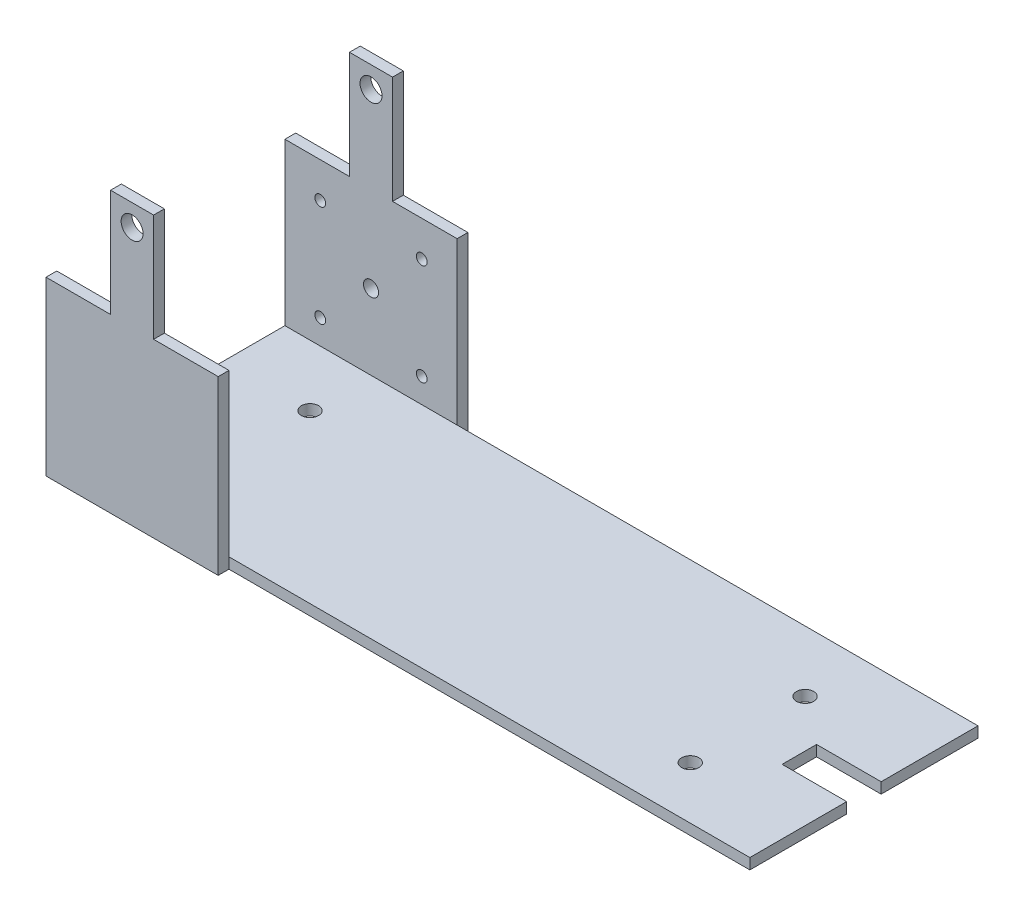
ISO-10303-21;
HEADER;
FILE_DESCRIPTION(('STEP AP214'),'2;1');
FILE_NAME('part.step','',(''),(''),'','','');
FILE_SCHEMA(('AUTOMOTIVE_DESIGN { 1 0 10303 214 1 1 1 1 }'));
ENDSEC;
DATA;
#1=APPLICATION_CONTEXT('core data for automotive mechanical design processes');
#2=APPLICATION_PROTOCOL_DEFINITION('international standard','automotive_design',2000,#1);
#3=PRODUCT_CONTEXT('',#1,'mechanical');
#4=PRODUCT('Part','Part','',(#3));
#5=PRODUCT_RELATED_PRODUCT_CATEGORY('part','',(#4));
#6=PRODUCT_DEFINITION_FORMATION('','',#4);
#7=PRODUCT_DEFINITION_CONTEXT('part definition',#1,'design');
#8=PRODUCT_DEFINITION('design','',#6,#7);
#9=PRODUCT_DEFINITION_SHAPE('','',#8);
#10=(LENGTH_UNIT() NAMED_UNIT(*) SI_UNIT(.MILLI.,.METRE.));
#11=(NAMED_UNIT(*) PLANE_ANGLE_UNIT() SI_UNIT($,.RADIAN.));
#12=(NAMED_UNIT(*) SI_UNIT($,.STERADIAN.) SOLID_ANGLE_UNIT());
#13=UNCERTAINTY_MEASURE_WITH_UNIT(LENGTH_MEASURE(1.E-05),#10,'distance_accuracy_value','');
#14=(GEOMETRIC_REPRESENTATION_CONTEXT(3) GLOBAL_UNCERTAINTY_ASSIGNED_CONTEXT((#13)) GLOBAL_UNIT_ASSIGNED_CONTEXT((#10,
#11,#12)) REPRESENTATION_CONTEXT('',''));
#15=CARTESIAN_POINT('',(0.,0.,0.));
#16=DIRECTION('',(0.,0.,1.));
#17=DIRECTION('',(1.,0.,0.));
#18=AXIS2_PLACEMENT_3D('',#15,#16,#17);
#19=CARTESIAN_POINT('',(282.,-115.,111.));
#20=DIRECTION('',(-1.,0.,0.));
#21=DIRECTION('',(0.,0.,1.));
#22=AXIS2_PLACEMENT_3D('',#19,#20,#21);
#23=PLANE('',#22);
#24=DIRECTION('',(0.,0.,-1.));
#25=VECTOR('',#24,1.);
#26=CARTESIAN_POINT('',(282.,-120.,111.));
#27=LINE('',#26,#25);
#28=CARTESIAN_POINT('',(282.,-120.,111.));
#29=VERTEX_POINT('',#28);
#30=CARTESIAN_POINT('',(282.,-120.,66.));
#31=VERTEX_POINT('',#30);
#32=EDGE_CURVE('E389',#29,#31,#27,.T.);
#33=ORIENTED_EDGE('',*,*,#32,.T.);
#34=DIRECTION('',(0.,1.,0.));
#35=VECTOR('',#34,1.);
#36=CARTESIAN_POINT('',(282.,-125.,66.));
#37=LINE('',#36,#35);
#38=CARTESIAN_POINT('',(282.,-115.,66.));
#39=VERTEX_POINT('',#38);
#40=EDGE_CURVE('E230',#31,#39,#37,.T.);
#41=ORIENTED_EDGE('',*,*,#40,.T.);
#42=DIRECTION('',(0.,0.,-1.));
#43=VECTOR('',#42,1.);
#44=CARTESIAN_POINT('',(282.,-115.,111.));
#45=LINE('',#44,#43);
#46=CARTESIAN_POINT('',(282.,-115.,111.));
#47=VERTEX_POINT('',#46);
#48=EDGE_CURVE('E385',#47,#39,#45,.T.);
#49=ORIENTED_EDGE('',*,*,#48,.F.);
#50=DIRECTION('',(0.,1.,0.));
#51=VECTOR('',#50,1.);
#52=CARTESIAN_POINT('',(282.,-115.,111.));
#53=LINE('',#52,#51);
#54=EDGE_CURVE('E364',#29,#47,#53,.T.);
#55=ORIENTED_EDGE('',*,*,#54,.F.);
#56=EDGE_LOOP('',(#33,#41,#49,#55));
#57=FACE_BOUND('',#56,.T.);
#58=ADVANCED_FACE('F41',(#57),#23,.F.);
#59=CARTESIAN_POINT('',(0.,0.,111.));
#60=DIRECTION('',(0.,0.,-1.));
#61=DIRECTION('',(-1.,0.,0.));
#62=AXIS2_PLACEMENT_3D('',#59,#60,#61);
#63=PLANE('',#62);
#64=DIRECTION('',(0.,1.,0.));
#65=VECTOR('',#64,1.);
#66=CARTESIAN_POINT('',(40.,-115.,111.));
#67=LINE('',#66,#65);
#68=CARTESIAN_POINT('',(40.,-120.,111.));
#69=VERTEX_POINT('',#68);
#70=CARTESIAN_POINT('',(40.,-115.,111.));
#71=VERTEX_POINT('',#70);
#72=EDGE_CURVE('E68',#69,#71,#67,.T.);
#73=ORIENTED_EDGE('',*,*,#72,.F.);
#74=DIRECTION('',(1.,0.,0.));
#75=VECTOR('',#74,1.);
#76=CARTESIAN_POINT('',(282.,-120.,111.));
#77=LINE('',#76,#75);
#78=EDGE_CURVE('E361',#69,#29,#77,.T.);
#79=ORIENTED_EDGE('',*,*,#78,.T.);
#80=ORIENTED_EDGE('',*,*,#54,.T.);
#81=DIRECTION('',(-1.,0.,0.));
#82=VECTOR('',#81,1.);
#83=CARTESIAN_POINT('',(-40.,-115.,111.));
#84=LINE('',#83,#82);
#85=EDGE_CURVE('E368',#47,#71,#84,.T.);
#86=ORIENTED_EDGE('',*,*,#85,.T.);
#87=EDGE_LOOP('',(#73,#79,#80,#86));
#88=FACE_BOUND('',#87,.T.);
#89=ADVANCED_FACE('F559',(#88),#63,.F.);
#90=CARTESIAN_POINT('',(0.,0.,5.));
#91=DIRECTION('',(0.,0.,-1.));
#92=DIRECTION('',(-1.,0.,0.));
#93=AXIS2_PLACEMENT_3D('',#90,#91,#92);
#94=PLANE('',#93);
#95=CARTESIAN_POINT('',(0.,-80.,5.));
#96=DIRECTION('',(0.,0.,1.));
#97=DIRECTION('',(1.,0.,0.));
#98=AXIS2_PLACEMENT_3D('',#95,#96,#97);
#99=CIRCLE('',#98,3.5);
#100=CARTESIAN_POINT('',(3.5,-80.,5.));
#101=VERTEX_POINT('',#100);
#102=EDGE_CURVE('E410',#101,#101,#99,.T.);
#103=ORIENTED_EDGE('',*,*,#102,.F.);
#104=EDGE_LOOP('',(#103));
#105=FACE_BOUND('',#104,.T.);
#106=CARTESIAN_POINT('',(0.,0.,5.));
#107=DIRECTION('',(0.,0.,1.));
#108=DIRECTION('',(1.,0.,0.));
#109=AXIS2_PLACEMENT_3D('',#106,#107,#108);
#110=CIRCLE('',#109,5.1);
#111=CARTESIAN_POINT('',(5.1,0.,5.));
#112=VERTEX_POINT('',#111);
#113=EDGE_CURVE('E419',#112,#112,#110,.T.);
#114=ORIENTED_EDGE('',*,*,#113,.F.);
#115=EDGE_LOOP('',(#114));
#116=FACE_BOUND('',#115,.T.);
#117=CARTESIAN_POINT('',(-23.5700000000004,-56.4299999999999,5.));
#118=DIRECTION('',(0.,0.,1.));
#119=DIRECTION('',(1.,0.,0.));
#120=AXIS2_PLACEMENT_3D('',#117,#118,#119);
#121=CIRCLE('',#120,2.5);
#122=CARTESIAN_POINT('',(-21.0700000000004,-56.4299999999999,5.));
#123=VERTEX_POINT('',#122);
#124=EDGE_CURVE('E402',#123,#123,#121,.T.);
#125=ORIENTED_EDGE('',*,*,#124,.F.);
#126=EDGE_LOOP('',(#125));
#127=FACE_BOUND('',#126,.T.);
#128=CARTESIAN_POINT('',(23.5699999999995,-103.57,5.));
#129=DIRECTION('',(0.,0.,1.));
#130=DIRECTION('',(1.,0.,0.));
#131=AXIS2_PLACEMENT_3D('',#128,#129,#130);
#132=CIRCLE('',#131,2.5);
#133=CARTESIAN_POINT('',(26.0699999999996,-103.57,5.));
#134=VERTEX_POINT('',#133);
#135=EDGE_CURVE('E393',#134,#134,#132,.T.);
#136=ORIENTED_EDGE('',*,*,#135,.F.);
#137=EDGE_LOOP('',(#136));
#138=FACE_BOUND('',#137,.T.);
#139=CARTESIAN_POINT('',(-23.5700000000004,-103.57,5.));
#140=DIRECTION('',(0.,0.,1.));
#141=DIRECTION('',(1.,0.,0.));
#142=AXIS2_PLACEMENT_3D('',#139,#140,#141);
#143=CIRCLE('',#142,2.5);
#144=CARTESIAN_POINT('',(-21.0700000000004,-103.57,5.));
#145=VERTEX_POINT('',#144);
#146=EDGE_CURVE('E397',#145,#145,#143,.T.);
#147=ORIENTED_EDGE('',*,*,#146,.F.);
#148=EDGE_LOOP('',(#147));
#149=FACE_BOUND('',#148,.T.);
#150=CARTESIAN_POINT('',(23.5699999999995,-56.4299999999999,5.));
#151=DIRECTION('',(0.,0.,1.));
#152=DIRECTION('',(1.,0.,0.));
#153=AXIS2_PLACEMENT_3D('',#150,#151,#152);
#154=CIRCLE('',#153,2.5);
#155=CARTESIAN_POINT('',(26.0699999999995,-56.4299999999999,5.));
#156=VERTEX_POINT('',#155);
#157=EDGE_CURVE('E398',#156,#156,#154,.T.);
#158=ORIENTED_EDGE('',*,*,#157,.F.);
#159=EDGE_LOOP('',(#158));
#160=FACE_BOUND('',#159,.T.);
#161=DIRECTION('',(-1.,0.,0.));
#162=VECTOR('',#161,1.);
#163=CARTESIAN_POINT('',(-40.,-115.,5.));
#164=LINE('',#163,#162);
#165=CARTESIAN_POINT('',(40.,-115.,5.));
#166=VERTEX_POINT('',#165);
#167=CARTESIAN_POINT('',(-40.,-115.,5.));
#168=VERTEX_POINT('',#167);
#169=EDGE_CURVE('E11',#166,#168,#164,.T.);
#170=ORIENTED_EDGE('',*,*,#169,.F.);
#171=DIRECTION('',(0.,1.,0.));
#172=VECTOR('',#171,1.);
#173=CARTESIAN_POINT('',(40.,-40.,5.));
#174=LINE('',#173,#172);
#175=CARTESIAN_POINT('',(40.,-40.,5.));
#176=VERTEX_POINT('',#175);
#177=EDGE_CURVE('E444',#166,#176,#174,.T.);
#178=ORIENTED_EDGE('',*,*,#177,.T.);
#179=DIRECTION('',(-1.,0.,0.));
#180=VECTOR('',#179,1.);
#181=CARTESIAN_POINT('',(10.,-40.,5.));
#182=LINE('',#181,#180);
#183=CARTESIAN_POINT('',(10.,-40.,5.));
#184=VERTEX_POINT('',#183);
#185=EDGE_CURVE('E449',#176,#184,#182,.T.);
#186=ORIENTED_EDGE('',*,*,#185,.T.);
#187=DIRECTION('',(0.,1.,0.));
#188=VECTOR('',#187,1.);
#189=CARTESIAN_POINT('',(10.,-40.,5.));
#190=LINE('',#189,#188);
#191=CARTESIAN_POINT('',(10.,10.,5.));
#192=VERTEX_POINT('',#191);
#193=EDGE_CURVE('E427',#184,#192,#190,.T.);
#194=ORIENTED_EDGE('',*,*,#193,.T.);
#195=DIRECTION('',(-1.,0.,0.));
#196=VECTOR('',#195,1.);
#197=CARTESIAN_POINT('',(-10.,10.,5.));
#198=LINE('',#197,#196);
#199=CARTESIAN_POINT('',(-10.,10.,5.));
#200=VERTEX_POINT('',#199);
#201=EDGE_CURVE('E431',#192,#200,#198,.T.);
#202=ORIENTED_EDGE('',*,*,#201,.T.);
#203=DIRECTION('',(0.,-1.,0.));
#204=VECTOR('',#203,1.);
#205=CARTESIAN_POINT('',(-10.,-40.,5.));
#206=LINE('',#205,#204);
#207=CARTESIAN_POINT('',(-10.,-40.,5.));
#208=VERTEX_POINT('',#207);
#209=EDGE_CURVE('E435',#200,#208,#206,.T.);
#210=ORIENTED_EDGE('',*,*,#209,.T.);
#211=DIRECTION('',(-1.,0.,0.));
#212=VECTOR('',#211,1.);
#213=CARTESIAN_POINT('',(-40.,-40.,5.));
#214=LINE('',#213,#212);
#215=CARTESIAN_POINT('',(-40.,-40.,5.));
#216=VERTEX_POINT('',#215);
#217=EDGE_CURVE('E438',#208,#216,#214,.T.);
#218=ORIENTED_EDGE('',*,*,#217,.T.);
#219=DIRECTION('',(0.,-1.,0.));
#220=VECTOR('',#219,1.);
#221=CARTESIAN_POINT('',(-40.,-120.,5.));
#222=LINE('',#221,#220);
#223=EDGE_CURVE('E441',#216,#168,#222,.T.);
#224=ORIENTED_EDGE('',*,*,#223,.T.);
#225=EDGE_LOOP('',(#170,#178,#186,#194,#202,#210,#218,#224));
#226=FACE_BOUND('',#225,.T.);
#227=ADVANCED_FACE('F528',(#105,#116,#127,#138,#149,#160,#226),#94,.F.);
#228=CARTESIAN_POINT('',(0.,0.,0.));
#229=DIRECTION('',(0.,0.,-1.));
#230=DIRECTION('',(-1.,0.,0.));
#231=AXIS2_PLACEMENT_3D('',#228,#229,#230);
#232=PLANE('',#231);
#233=CARTESIAN_POINT('',(23.5699999999995,-56.4299999999999,0.));
#234=DIRECTION('',(0.,0.,-1.));
#235=DIRECTION('',(-1.,0.,0.));
#236=AXIS2_PLACEMENT_3D('',#233,#234,#235);
#237=CIRCLE('',#236,2.5);
#238=CARTESIAN_POINT('',(21.0699999999995,-56.4299999999999,0.));
#239=VERTEX_POINT('',#238);
#240=EDGE_CURVE('E45',#239,#239,#237,.T.);
#241=ORIENTED_EDGE('',*,*,#240,.F.);
#242=EDGE_LOOP('',(#241));
#243=FACE_BOUND('',#242,.T.);
#244=CARTESIAN_POINT('',(-23.5700000000004,-103.57,0.));
#245=DIRECTION('',(0.,0.,-1.));
#246=DIRECTION('',(-1.,0.,0.));
#247=AXIS2_PLACEMENT_3D('',#244,#245,#246);
#248=CIRCLE('',#247,2.5);
#249=CARTESIAN_POINT('',(-26.0700000000004,-103.57,0.));
#250=VERTEX_POINT('',#249);
#251=EDGE_CURVE('E512',#250,#250,#248,.T.);
#252=ORIENTED_EDGE('',*,*,#251,.F.);
#253=EDGE_LOOP('',(#252));
#254=FACE_BOUND('',#253,.T.);
#255=CARTESIAN_POINT('',(23.5699999999995,-103.57,0.));
#256=DIRECTION('',(0.,0.,-1.));
#257=DIRECTION('',(-1.,0.,0.));
#258=AXIS2_PLACEMENT_3D('',#255,#256,#257);
#259=CIRCLE('',#258,2.5);
#260=CARTESIAN_POINT('',(21.0699999999995,-103.57,0.));
#261=VERTEX_POINT('',#260);
#262=EDGE_CURVE('E509',#261,#261,#259,.T.);
#263=ORIENTED_EDGE('',*,*,#262,.F.);
#264=EDGE_LOOP('',(#263));
#265=FACE_BOUND('',#264,.T.);
#266=CARTESIAN_POINT('',(-23.5700000000004,-56.4299999999999,0.));
#267=DIRECTION('',(0.,0.,-1.));
#268=DIRECTION('',(-1.,0.,0.));
#269=AXIS2_PLACEMENT_3D('',#266,#267,#268);
#270=CIRCLE('',#269,2.5);
#271=CARTESIAN_POINT('',(-26.0700000000004,-56.4299999999999,0.));
#272=VERTEX_POINT('',#271);
#273=EDGE_CURVE('E409',#272,#272,#270,.T.);
#274=ORIENTED_EDGE('',*,*,#273,.F.);
#275=EDGE_LOOP('',(#274));
#276=FACE_BOUND('',#275,.T.);
#277=CARTESIAN_POINT('',(0.,0.,0.));
#278=DIRECTION('',(0.,0.,1.));
#279=DIRECTION('',(1.,0.,0.));
#280=AXIS2_PLACEMENT_3D('',#277,#278,#279);
#281=CIRCLE('',#280,5.1);
#282=CARTESIAN_POINT('',(5.1,0.,0.));
#283=VERTEX_POINT('',#282);
#284=EDGE_CURVE('E414',#283,#283,#281,.T.);
#285=ORIENTED_EDGE('',*,*,#284,.T.);
#286=EDGE_LOOP('',(#285));
#287=FACE_BOUND('',#286,.T.);
#288=DIRECTION('',(0.,1.,0.));
#289=VECTOR('',#288,1.);
#290=CARTESIAN_POINT('',(10.,-40.,0.));
#291=LINE('',#290,#289);
#292=CARTESIAN_POINT('',(10.,-40.,0.));
#293=VERTEX_POINT('',#292);
#294=CARTESIAN_POINT('',(10.,10.,0.));
#295=VERTEX_POINT('',#294);
#296=EDGE_CURVE('E423',#293,#295,#291,.T.);
#297=ORIENTED_EDGE('',*,*,#296,.F.);
#298=DIRECTION('',(-1.,0.,0.));
#299=VECTOR('',#298,1.);
#300=CARTESIAN_POINT('',(10.,-40.,0.));
#301=LINE('',#300,#299);
#302=CARTESIAN_POINT('',(40.,-40.,0.));
#303=VERTEX_POINT('',#302);
#304=EDGE_CURVE('E432',#303,#293,#301,.T.);
#305=ORIENTED_EDGE('',*,*,#304,.F.);
#306=DIRECTION('',(0.,1.,0.));
#307=VECTOR('',#306,1.);
#308=CARTESIAN_POINT('',(40.,-40.,0.));
#309=LINE('',#308,#307);
#310=CARTESIAN_POINT('',(40.,-120.,0.));
#311=VERTEX_POINT('',#310);
#312=EDGE_CURVE('E471',#311,#303,#309,.T.);
#313=ORIENTED_EDGE('',*,*,#312,.F.);
#314=DIRECTION('',(1.,0.,0.));
#315=VECTOR('',#314,1.);
#316=CARTESIAN_POINT('',(40.,-120.,0.));
#317=LINE('',#316,#315);
#318=CARTESIAN_POINT('',(-40.,-120.,0.));
#319=VERTEX_POINT('',#318);
#320=EDGE_CURVE('E468',#319,#311,#317,.T.);
#321=ORIENTED_EDGE('',*,*,#320,.F.);
#322=DIRECTION('',(0.,-1.,0.));
#323=VECTOR('',#322,1.);
#324=CARTESIAN_POINT('',(-40.,-120.,0.));
#325=LINE('',#324,#323);
#326=CARTESIAN_POINT('',(-40.,-40.,0.));
#327=VERTEX_POINT('',#326);
#328=EDGE_CURVE('E465',#327,#319,#325,.T.);
#329=ORIENTED_EDGE('',*,*,#328,.F.);
#330=DIRECTION('',(-1.,0.,0.));
#331=VECTOR('',#330,1.);
#332=CARTESIAN_POINT('',(-40.,-40.,0.));
#333=LINE('',#332,#331);
#334=CARTESIAN_POINT('',(-10.,-40.,0.));
#335=VERTEX_POINT('',#334);
#336=EDGE_CURVE('E462',#335,#327,#333,.T.);
#337=ORIENTED_EDGE('',*,*,#336,.F.);
#338=DIRECTION('',(0.,-1.,0.));
#339=VECTOR('',#338,1.);
#340=CARTESIAN_POINT('',(-10.,-40.,0.));
#341=LINE('',#340,#339);
#342=CARTESIAN_POINT('',(-10.,10.,0.));
#343=VERTEX_POINT('',#342);
#344=EDGE_CURVE('E459',#343,#335,#341,.T.);
#345=ORIENTED_EDGE('',*,*,#344,.F.);
#346=DIRECTION('',(-1.,0.,0.));
#347=VECTOR('',#346,1.);
#348=CARTESIAN_POINT('',(-10.,10.,0.));
#349=LINE('',#348,#347);
#350=EDGE_CURVE('E456',#295,#343,#349,.T.);
#351=ORIENTED_EDGE('',*,*,#350,.F.);
#352=EDGE_LOOP('',(#297,#305,#313,#321,#329,#337,#345,#351));
#353=FACE_BOUND('',#352,.T.);
#354=CARTESIAN_POINT('',(0.,-80.,0.));
#355=DIRECTION('',(0.,0.,1.));
#356=DIRECTION('',(1.,0.,0.));
#357=AXIS2_PLACEMENT_3D('',#354,#355,#356);
#358=CIRCLE('',#357,3.5);
#359=CARTESIAN_POINT('',(3.5,-80.,0.));
#360=VERTEX_POINT('',#359);
#361=EDGE_CURVE('E415',#360,#360,#358,.T.);
#362=ORIENTED_EDGE('',*,*,#361,.T.);
#363=EDGE_LOOP('',(#362));
#364=FACE_BOUND('',#363,.T.);
#365=ADVANCED_FACE('F525',(#243,#254,#265,#276,#287,#353,#364),#232,.T.);
#366=CARTESIAN_POINT('',(10.,-40.,5.));
#367=DIRECTION('',(-1.,0.,0.));
#368=DIRECTION('',(0.,0.,1.));
#369=AXIS2_PLACEMENT_3D('',#366,#367,#368);
#370=PLANE('',#369);
#371=ORIENTED_EDGE('',*,*,#296,.T.);
#372=DIRECTION('',(0.,0.,-1.));
#373=VECTOR('',#372,1.);
#374=CARTESIAN_POINT('',(10.,10.,5.));
#375=LINE('',#374,#373);
#376=EDGE_CURVE('E51',#192,#295,#375,.T.);
#377=ORIENTED_EDGE('',*,*,#376,.F.);
#378=ORIENTED_EDGE('',*,*,#193,.F.);
#379=DIRECTION('',(0.,0.,-1.));
#380=VECTOR('',#379,1.);
#381=CARTESIAN_POINT('',(10.,-40.,5.));
#382=LINE('',#381,#380);
#383=EDGE_CURVE('E452',#184,#293,#382,.T.);
#384=ORIENTED_EDGE('',*,*,#383,.T.);
#385=EDGE_LOOP('',(#371,#377,#378,#384));
#386=FACE_BOUND('',#385,.T.);
#387=ADVANCED_FACE('F43',(#386),#370,.F.);
#388=CARTESIAN_POINT('',(-10.,10.,5.));
#389=DIRECTION('',(0.,-1.,0.));
#390=DIRECTION('',(0.,0.,-1.));
#391=AXIS2_PLACEMENT_3D('',#388,#389,#390);
#392=PLANE('',#391);
#393=ORIENTED_EDGE('',*,*,#350,.T.);
#394=DIRECTION('',(0.,0.,-1.));
#395=VECTOR('',#394,1.);
#396=CARTESIAN_POINT('',(-10.,10.,5.));
#397=LINE('',#396,#395);
#398=EDGE_CURVE('E499',#200,#343,#397,.T.);
#399=ORIENTED_EDGE('',*,*,#398,.F.);
#400=ORIENTED_EDGE('',*,*,#201,.F.);
#401=ORIENTED_EDGE('',*,*,#376,.T.);
#402=EDGE_LOOP('',(#393,#399,#400,#401));
#403=FACE_BOUND('',#402,.T.);
#404=ADVANCED_FACE('F652',(#403),#392,.F.);
#405=CARTESIAN_POINT('',(-10.,-40.,5.));
#406=DIRECTION('',(1.,0.,0.));
#407=DIRECTION('',(0.,1.,0.));
#408=AXIS2_PLACEMENT_3D('',#405,#406,#407);
#409=PLANE('',#408);
#410=ORIENTED_EDGE('',*,*,#344,.T.);
#411=DIRECTION('',(0.,0.,-1.));
#412=VECTOR('',#411,1.);
#413=CARTESIAN_POINT('',(-10.,-40.,5.));
#414=LINE('',#413,#412);
#415=EDGE_CURVE('E495',#208,#335,#414,.T.);
#416=ORIENTED_EDGE('',*,*,#415,.F.);
#417=ORIENTED_EDGE('',*,*,#209,.F.);
#418=ORIENTED_EDGE('',*,*,#398,.T.);
#419=EDGE_LOOP('',(#410,#416,#417,#418));
#420=FACE_BOUND('',#419,.T.);
#421=ADVANCED_FACE('F657',(#420),#409,.F.);
#422=CARTESIAN_POINT('',(-40.,-40.,5.));
#423=DIRECTION('',(0.,-1.,0.));
#424=DIRECTION('',(1.,0.,0.));
#425=AXIS2_PLACEMENT_3D('',#422,#423,#424);
#426=PLANE('',#425);
#427=ORIENTED_EDGE('',*,*,#336,.T.);
#428=DIRECTION('',(0.,0.,-1.));
#429=VECTOR('',#428,1.);
#430=CARTESIAN_POINT('',(-40.,-40.,5.));
#431=LINE('',#430,#429);
#432=EDGE_CURVE('E491',#216,#327,#431,.T.);
#433=ORIENTED_EDGE('',*,*,#432,.F.);
#434=ORIENTED_EDGE('',*,*,#217,.F.);
#435=ORIENTED_EDGE('',*,*,#415,.T.);
#436=EDGE_LOOP('',(#427,#433,#434,#435));
#437=FACE_BOUND('',#436,.T.);
#438=ADVANCED_FACE('F661',(#437),#426,.F.);
#439=CARTESIAN_POINT('',(-40.,-120.,5.));
#440=DIRECTION('',(1.,0.,0.));
#441=DIRECTION('',(0.,0.,-1.));
#442=AXIS2_PLACEMENT_3D('',#439,#440,#441);
#443=PLANE('',#442);
#444=ORIENTED_EDGE('',*,*,#328,.T.);
#445=DIRECTION('',(0.,0.,-1.));
#446=VECTOR('',#445,1.);
#447=CARTESIAN_POINT('',(-40.,-120.,5.));
#448=LINE('',#447,#446);
#449=CARTESIAN_POINT('',(-40.,-120.,116.));
#450=VERTEX_POINT('',#449);
#451=EDGE_CURVE('E487',#450,#319,#448,.T.);
#452=ORIENTED_EDGE('',*,*,#451,.F.);
#453=DIRECTION('',(0.,-1.,0.));
#454=VECTOR('',#453,1.);
#455=CARTESIAN_POINT('',(-40.,-40.,116.));
#456=LINE('',#455,#454);
#457=CARTESIAN_POINT('',(-40.,-40.,116.));
#458=VERTEX_POINT('',#457);
#459=EDGE_CURVE('E285',#458,#450,#456,.T.);
#460=ORIENTED_EDGE('',*,*,#459,.F.);
#461=DIRECTION('',(0.,0.,-1.));
#462=VECTOR('',#461,1.);
#463=CARTESIAN_POINT('',(-40.,-40.,116.));
#464=LINE('',#463,#462);
#465=CARTESIAN_POINT('',(-40.,-40.,111.));
#466=VERTEX_POINT('',#465);
#467=EDGE_CURVE('E311',#458,#466,#464,.T.);
#468=ORIENTED_EDGE('',*,*,#467,.T.);
#469=DIRECTION('',(0.,-1.,0.));
#470=VECTOR('',#469,1.);
#471=CARTESIAN_POINT('',(-40.,-115.,111.));
#472=LINE('',#471,#470);
#473=CARTESIAN_POINT('',(-40.,-115.,111.));
#474=VERTEX_POINT('',#473);
#475=EDGE_CURVE('E281',#466,#474,#472,.T.);
#476=ORIENTED_EDGE('',*,*,#475,.T.);
#477=DIRECTION('',(0.,0.,-1.));
#478=VECTOR('',#477,1.);
#479=CARTESIAN_POINT('',(-40.,-115.,111.));
#480=LINE('',#479,#478);
#481=EDGE_CURVE('E371',#474,#168,#480,.T.);
#482=ORIENTED_EDGE('',*,*,#481,.T.);
#483=ORIENTED_EDGE('',*,*,#223,.F.);
#484=ORIENTED_EDGE('',*,*,#432,.T.);
#485=EDGE_LOOP('',(#444,#452,#460,#468,#476,#482,#483,#484));
#486=FACE_BOUND('',#485,.T.);
#487=ADVANCED_FACE('F594',(#486),#443,.F.);
#488=CARTESIAN_POINT('',(40.,-120.,5.));
#489=DIRECTION('',(0.,1.,0.));
#490=DIRECTION('',(0.,0.,1.));
#491=AXIS2_PLACEMENT_3D('',#488,#489,#490);
#492=PLANE('',#491);
#493=CARTESIAN_POINT('',(0.,-120.,33.3563387456499));
#494=DIRECTION('',(0.,1.,0.));
#495=DIRECTION('',(0.,0.,1.));
#496=AXIS2_PLACEMENT_3D('',#493,#494,#495);
#497=CIRCLE('',#496,4.);
#498=CARTESIAN_POINT('',(0.,-120.,37.3563387456499));
#499=VERTEX_POINT('',#498);
#500=EDGE_CURVE('E264',#499,#499,#497,.T.);
#501=ORIENTED_EDGE('',*,*,#500,.T.);
#502=EDGE_LOOP('',(#501));
#503=FACE_BOUND('',#502,.T.);
#504=CARTESIAN_POINT('',(0.,-120.,86.6762603686954));
#505=DIRECTION('',(0.,1.,0.));
#506=DIRECTION('',(0.,0.,1.));
#507=AXIS2_PLACEMENT_3D('',#504,#505,#506);
#508=CIRCLE('',#507,4.);
#509=CARTESIAN_POINT('',(0.,-120.,90.6762603686954));
#510=VERTEX_POINT('',#509);
#511=EDGE_CURVE('E260',#510,#510,#508,.T.);
#512=ORIENTED_EDGE('',*,*,#511,.T.);
#513=EDGE_LOOP('',(#512));
#514=FACE_BOUND('',#513,.T.);
#515=CARTESIAN_POINT('',(230.,-120.,86.6762603686954));
#516=DIRECTION('',(0.,1.,0.));
#517=DIRECTION('',(0.,0.,1.));
#518=AXIS2_PLACEMENT_3D('',#515,#516,#517);
#519=CIRCLE('',#518,3.99999999999999);
#520=CARTESIAN_POINT('',(230.,-120.,90.6762603686954));
#521=VERTEX_POINT('',#520);
#522=EDGE_CURVE('E256',#521,#521,#519,.T.);
#523=ORIENTED_EDGE('',*,*,#522,.T.);
#524=EDGE_LOOP('',(#523));
#525=FACE_BOUND('',#524,.T.);
#526=CARTESIAN_POINT('',(230.,-120.,33.3563387456499));
#527=DIRECTION('',(0.,1.,0.));
#528=DIRECTION('',(0.,0.,1.));
#529=AXIS2_PLACEMENT_3D('',#526,#527,#528);
#530=CIRCLE('',#529,3.99999999999999);
#531=CARTESIAN_POINT('',(230.,-120.,37.3563387456499));
#532=VERTEX_POINT('',#531);
#533=EDGE_CURVE('E234',#532,#532,#530,.T.);
#534=ORIENTED_EDGE('',*,*,#533,.T.);
#535=EDGE_LOOP('',(#534));
#536=FACE_BOUND('',#535,.T.);
#537=DIRECTION('',(0.,0.,1.));
#538=VECTOR('',#537,1.);
#539=CARTESIAN_POINT('',(252.,-120.,5.));
#540=LINE('',#539,#538);
#541=CARTESIAN_POINT('',(252.,-120.,50.));
#542=VERTEX_POINT('',#541);
#543=CARTESIAN_POINT('',(252.,-120.,66.));
#544=VERTEX_POINT('',#543);
#545=EDGE_CURVE('E208',#542,#544,#540,.T.);
#546=ORIENTED_EDGE('',*,*,#545,.T.);
#547=DIRECTION('',(1.,0.,0.));
#548=VECTOR('',#547,1.);
#549=CARTESIAN_POINT('',(40.,-120.,66.));
#550=LINE('',#549,#548);
#551=EDGE_CURVE('E273',#544,#31,#550,.T.);
#552=ORIENTED_EDGE('',*,*,#551,.T.);
#553=ORIENTED_EDGE('',*,*,#32,.F.);
#554=ORIENTED_EDGE('',*,*,#78,.F.);
#555=DIRECTION('',(0.,0.,-1.));
#556=VECTOR('',#555,1.);
#557=CARTESIAN_POINT('',(40.,-120.,116.));
#558=LINE('',#557,#556);
#559=CARTESIAN_POINT('',(40.,-120.,116.));
#560=VERTEX_POINT('',#559);
#561=EDGE_CURVE('E356',#560,#69,#558,.T.);
#562=ORIENTED_EDGE('',*,*,#561,.F.);
#563=DIRECTION('',(1.,0.,0.));
#564=VECTOR('',#563,1.);
#565=CARTESIAN_POINT('',(40.,-120.,116.));
#566=LINE('',#565,#564);
#567=EDGE_CURVE('E289',#450,#560,#566,.T.);
#568=ORIENTED_EDGE('',*,*,#567,.F.);
#569=ORIENTED_EDGE('',*,*,#451,.T.);
#570=ORIENTED_EDGE('',*,*,#320,.T.);
#571=DIRECTION('',(0.,0.,-1.));
#572=VECTOR('',#571,1.);
#573=CARTESIAN_POINT('',(40.,-120.,5.));
#574=LINE('',#573,#572);
#575=CARTESIAN_POINT('',(40.,-120.,5.));
#576=VERTEX_POINT('',#575);
#577=EDGE_CURVE('E483',#576,#311,#574,.T.);
#578=ORIENTED_EDGE('',*,*,#577,.F.);
#579=DIRECTION('',(1.,0.,0.));
#580=VECTOR('',#579,1.);
#581=CARTESIAN_POINT('',(282.,-120.,5.));
#582=LINE('',#581,#580);
#583=CARTESIAN_POINT('',(282.,-120.,5.));
#584=VERTEX_POINT('',#583);
#585=EDGE_CURVE('E360',#576,#584,#582,.T.);
#586=ORIENTED_EDGE('',*,*,#585,.T.);
#587=CARTESIAN_POINT('',(282.,-120.,50.));
#588=VERTEX_POINT('',#587);
#589=EDGE_CURVE('E388',#588,#584,#27,.T.);
#590=ORIENTED_EDGE('',*,*,#589,.F.);
#591=DIRECTION('',(-1.,0.,0.));
#592=VECTOR('',#591,1.);
#593=CARTESIAN_POINT('',(40.,-120.,50.));
#594=LINE('',#593,#592);
#595=EDGE_CURVE('E268',#588,#542,#594,.T.);
#596=ORIENTED_EDGE('',*,*,#595,.T.);
#597=EDGE_LOOP('',(#546,#552,#553,#554,#562,#568,#569,#570,#578,#586,#590,#596));
#598=FACE_BOUND('',#597,.T.);
#599=ADVANCED_FACE('F628',(#503,#514,#525,#536,#598),#492,.F.);
#600=CARTESIAN_POINT('',(40.,-40.,5.));
#601=DIRECTION('',(-1.,0.,0.));
#602=DIRECTION('',(0.,-1.,0.));
#603=AXIS2_PLACEMENT_3D('',#600,#601,#602);
#604=PLANE('',#603);
#605=ORIENTED_EDGE('',*,*,#312,.T.);
#606=DIRECTION('',(0.,0.,-1.));
#607=VECTOR('',#606,1.);
#608=CARTESIAN_POINT('',(40.,-40.,5.));
#609=LINE('',#608,#607);
#610=EDGE_CURVE('E479',#176,#303,#609,.T.);
#611=ORIENTED_EDGE('',*,*,#610,.F.);
#612=ORIENTED_EDGE('',*,*,#177,.F.);
#613=EDGE_CURVE('E445',#576,#166,#174,.T.);
#614=ORIENTED_EDGE('',*,*,#613,.F.);
#615=ORIENTED_EDGE('',*,*,#577,.T.);
#616=EDGE_LOOP('',(#605,#611,#612,#614,#615));
#617=FACE_BOUND('',#616,.T.);
#618=ADVANCED_FACE('F642',(#617),#604,.F.);
#619=CARTESIAN_POINT('',(10.,-40.,5.));
#620=DIRECTION('',(0.,-1.,0.));
#621=DIRECTION('',(0.,0.,-1.));
#622=AXIS2_PLACEMENT_3D('',#619,#620,#621);
#623=PLANE('',#622);
#624=ORIENTED_EDGE('',*,*,#304,.T.);
#625=ORIENTED_EDGE('',*,*,#383,.F.);
#626=ORIENTED_EDGE('',*,*,#185,.F.);
#627=ORIENTED_EDGE('',*,*,#610,.T.);
#628=EDGE_LOOP('',(#624,#625,#626,#627));
#629=FACE_BOUND('',#628,.T.);
#630=ADVANCED_FACE('F555',(#629),#623,.F.);
#631=CARTESIAN_POINT('',(0.,0.,5.));
#632=DIRECTION('',(0.,0.,-1.));
#633=DIRECTION('',(-1.,0.,0.));
#634=AXIS2_PLACEMENT_3D('',#631,#632,#633);
#635=CYLINDRICAL_SURFACE('',#634,5.1);
#636=ORIENTED_EDGE('',*,*,#113,.T.);
#637=EDGE_LOOP('',(#636));
#638=FACE_BOUND('',#637,.T.);
#639=ORIENTED_EDGE('',*,*,#284,.F.);
#640=EDGE_LOOP('',(#639));
#641=FACE_BOUND('',#640,.T.);
#642=ADVANCED_FACE('F545',(#638,#641),#635,.F.);
#643=CARTESIAN_POINT('',(0.,-80.,5.));
#644=DIRECTION('',(0.,0.,-1.));
#645=DIRECTION('',(-1.,0.,0.));
#646=AXIS2_PLACEMENT_3D('',#643,#644,#645);
#647=CYLINDRICAL_SURFACE('',#646,3.5);
#648=ORIENTED_EDGE('',*,*,#102,.T.);
#649=EDGE_LOOP('',(#648));
#650=FACE_BOUND('',#649,.T.);
#651=ORIENTED_EDGE('',*,*,#361,.F.);
#652=EDGE_LOOP('',(#651));
#653=FACE_BOUND('',#652,.T.);
#654=ADVANCED_FACE('F542',(#650,#653),#647,.F.);
#655=CARTESIAN_POINT('',(-23.5700000000004,-56.4299999999999,-5.));
#656=DIRECTION('',(0.,0.,1.));
#657=DIRECTION('',(1.,0.,0.));
#658=AXIS2_PLACEMENT_3D('',#655,#656,#657);
#659=CYLINDRICAL_SURFACE('',#658,2.5);
#660=ORIENTED_EDGE('',*,*,#273,.T.);
#661=EDGE_LOOP('',(#660));
#662=FACE_BOUND('',#661,.T.);
#663=ORIENTED_EDGE('',*,*,#124,.T.);
#664=EDGE_LOOP('',(#663));
#665=FACE_BOUND('',#664,.T.);
#666=ADVANCED_FACE('F544',(#662,#665),#659,.F.);
#667=CARTESIAN_POINT('',(23.5699999999995,-103.57,-5.));
#668=DIRECTION('',(0.,0.,1.));
#669=DIRECTION('',(1.,0.,0.));
#670=AXIS2_PLACEMENT_3D('',#667,#668,#669);
#671=CYLINDRICAL_SURFACE('',#670,2.5);
#672=ORIENTED_EDGE('',*,*,#262,.T.);
#673=EDGE_LOOP('',(#672));
#674=FACE_BOUND('',#673,.T.);
#675=ORIENTED_EDGE('',*,*,#135,.T.);
#676=EDGE_LOOP('',(#675));
#677=FACE_BOUND('',#676,.T.);
#678=ADVANCED_FACE('F552',(#674,#677),#671,.F.);
#679=CARTESIAN_POINT('',(-23.5700000000004,-103.57,-5.));
#680=DIRECTION('',(0.,0.,1.));
#681=DIRECTION('',(1.,0.,0.));
#682=AXIS2_PLACEMENT_3D('',#679,#680,#681);
#683=CYLINDRICAL_SURFACE('',#682,2.5);
#684=ORIENTED_EDGE('',*,*,#251,.T.);
#685=EDGE_LOOP('',(#684));
#686=FACE_BOUND('',#685,.T.);
#687=ORIENTED_EDGE('',*,*,#146,.T.);
#688=EDGE_LOOP('',(#687));
#689=FACE_BOUND('',#688,.T.);
#690=ADVANCED_FACE('F577',(#686,#689),#683,.F.);
#691=CARTESIAN_POINT('',(23.5699999999995,-56.4299999999999,-5.));
#692=DIRECTION('',(0.,0.,1.));
#693=DIRECTION('',(1.,0.,0.));
#694=AXIS2_PLACEMENT_3D('',#691,#692,#693);
#695=CYLINDRICAL_SURFACE('',#694,2.5);
#696=ORIENTED_EDGE('',*,*,#240,.T.);
#697=EDGE_LOOP('',(#696));
#698=FACE_BOUND('',#697,.T.);
#699=ORIENTED_EDGE('',*,*,#157,.T.);
#700=EDGE_LOOP('',(#699));
#701=FACE_BOUND('',#700,.T.);
#702=ADVANCED_FACE('F522',(#698,#701),#695,.F.);
#703=CARTESIAN_POINT('',(282.,-115.,50.));
#704=VERTEX_POINT('',#703);
#705=CARTESIAN_POINT('',(282.,-115.,5.));
#706=VERTEX_POINT('',#705);
#707=EDGE_CURVE('E384',#704,#706,#45,.T.);
#708=ORIENTED_EDGE('',*,*,#707,.F.);
#709=DIRECTION('',(0.,1.,0.));
#710=VECTOR('',#709,1.);
#711=CARTESIAN_POINT('',(282.,-125.,50.));
#712=LINE('',#711,#710);
#713=EDGE_CURVE('E60',#588,#704,#712,.T.);
#714=ORIENTED_EDGE('',*,*,#713,.F.);
#715=ORIENTED_EDGE('',*,*,#589,.T.);
#716=DIRECTION('',(0.,1.,0.));
#717=VECTOR('',#716,1.);
#718=CARTESIAN_POINT('',(282.,-115.,5.));
#719=LINE('',#718,#717);
#720=EDGE_CURVE('E375',#584,#706,#719,.T.);
#721=ORIENTED_EDGE('',*,*,#720,.T.);
#722=EDGE_LOOP('',(#708,#714,#715,#721));
#723=FACE_BOUND('',#722,.T.);
#724=ADVANCED_FACE('F562',(#723),#23,.F.);
#725=CARTESIAN_POINT('',(-40.,-115.,111.));
#726=DIRECTION('',(0.,-1.,0.));
#727=DIRECTION('',(0.,0.,-1.));
#728=AXIS2_PLACEMENT_3D('',#725,#726,#727);
#729=PLANE('',#728);
#730=CARTESIAN_POINT('',(0.,-115.,33.3563387456499));
#731=DIRECTION('',(0.,1.,0.));
#732=DIRECTION('',(0.,0.,1.));
#733=AXIS2_PLACEMENT_3D('',#730,#731,#732);
#734=CIRCLE('',#733,4.);
#735=CARTESIAN_POINT('',(0.,-115.,37.3563387456499));
#736=VERTEX_POINT('',#735);
#737=EDGE_CURVE('E218',#736,#736,#734,.T.);
#738=ORIENTED_EDGE('',*,*,#737,.F.);
#739=EDGE_LOOP('',(#738));
#740=FACE_BOUND('',#739,.T.);
#741=CARTESIAN_POINT('',(0.,-115.,86.6762603686954));
#742=DIRECTION('',(0.,1.,0.));
#743=DIRECTION('',(0.,0.,1.));
#744=AXIS2_PLACEMENT_3D('',#741,#742,#743);
#745=CIRCLE('',#744,4.);
#746=CARTESIAN_POINT('',(0.,-115.,90.6762603686954));
#747=VERTEX_POINT('',#746);
#748=EDGE_CURVE('E242',#747,#747,#745,.T.);
#749=ORIENTED_EDGE('',*,*,#748,.F.);
#750=EDGE_LOOP('',(#749));
#751=FACE_BOUND('',#750,.T.);
#752=CARTESIAN_POINT('',(230.,-115.,86.6762603686954));
#753=DIRECTION('',(0.,1.,0.));
#754=DIRECTION('',(0.,0.,1.));
#755=AXIS2_PLACEMENT_3D('',#752,#753,#754);
#756=CIRCLE('',#755,3.99999999999999);
#757=CARTESIAN_POINT('',(230.,-115.,90.6762603686954));
#758=VERTEX_POINT('',#757);
#759=EDGE_CURVE('E245',#758,#758,#756,.T.);
#760=ORIENTED_EDGE('',*,*,#759,.F.);
#761=EDGE_LOOP('',(#760));
#762=FACE_BOUND('',#761,.T.);
#763=CARTESIAN_POINT('',(230.,-115.,33.3563387456499));
#764=DIRECTION('',(0.,1.,0.));
#765=DIRECTION('',(0.,0.,1.));
#766=AXIS2_PLACEMENT_3D('',#763,#764,#765);
#767=CIRCLE('',#766,3.99999999999999);
#768=CARTESIAN_POINT('',(230.,-115.,37.3563387456499));
#769=VERTEX_POINT('',#768);
#770=EDGE_CURVE('E249',#769,#769,#767,.T.);
#771=ORIENTED_EDGE('',*,*,#770,.F.);
#772=EDGE_LOOP('',(#771));
#773=FACE_BOUND('',#772,.T.);
#774=ORIENTED_EDGE('',*,*,#48,.T.);
#775=DIRECTION('',(1.,0.,0.));
#776=VECTOR('',#775,1.);
#777=CARTESIAN_POINT('',(282.,-115.,66.));
#778=LINE('',#777,#776);
#779=CARTESIAN_POINT('',(252.,-115.,66.));
#780=VERTEX_POINT('',#779);
#781=EDGE_CURVE('E222',#780,#39,#778,.T.);
#782=ORIENTED_EDGE('',*,*,#781,.F.);
#783=DIRECTION('',(0.,0.,1.));
#784=VECTOR('',#783,1.);
#785=CARTESIAN_POINT('',(252.,-115.,66.));
#786=LINE('',#785,#784);
#787=CARTESIAN_POINT('',(252.,-115.,50.));
#788=VERTEX_POINT('',#787);
#789=EDGE_CURVE('E205',#788,#780,#786,.T.);
#790=ORIENTED_EDGE('',*,*,#789,.F.);
#791=DIRECTION('',(-1.,0.,0.));
#792=VECTOR('',#791,1.);
#793=CARTESIAN_POINT('',(282.,-115.,50.));
#794=LINE('',#793,#792);
#795=EDGE_CURVE('E213',#704,#788,#794,.T.);
#796=ORIENTED_EDGE('',*,*,#795,.F.);
#797=ORIENTED_EDGE('',*,*,#707,.T.);
#798=EDGE_CURVE('E53',#706,#166,#164,.T.);
#799=ORIENTED_EDGE('',*,*,#798,.T.);
#800=ORIENTED_EDGE('',*,*,#169,.T.);
#801=ORIENTED_EDGE('',*,*,#481,.F.);
#802=EDGE_CURVE('E367',#71,#474,#84,.T.);
#803=ORIENTED_EDGE('',*,*,#802,.F.);
#804=ORIENTED_EDGE('',*,*,#85,.F.);
#805=EDGE_LOOP('',(#774,#782,#790,#796,#797,#799,#800,#801,#803,#804));
#806=FACE_BOUND('',#805,.T.);
#807=ADVANCED_FACE('F221',(#740,#751,#762,#773,#806),#729,.F.);
#808=CARTESIAN_POINT('',(0.,0.,5.));
#809=DIRECTION('',(0.,0.,-1.));
#810=DIRECTION('',(-1.,0.,0.));
#811=AXIS2_PLACEMENT_3D('',#808,#809,#810);
#812=PLANE('',#811);
#813=ORIENTED_EDGE('',*,*,#585,.F.);
#814=ORIENTED_EDGE('',*,*,#613,.T.);
#815=ORIENTED_EDGE('',*,*,#798,.F.);
#816=ORIENTED_EDGE('',*,*,#720,.F.);
#817=EDGE_LOOP('',(#813,#814,#815,#816));
#818=FACE_BOUND('',#817,.T.);
#819=ADVANCED_FACE('F575',(#818),#812,.T.);
#820=CARTESIAN_POINT('',(0.,0.,116.));
#821=DIRECTION('',(0.,0.,-1.));
#822=DIRECTION('',(-1.,0.,0.));
#823=AXIS2_PLACEMENT_3D('',#820,#821,#822);
#824=PLANE('',#823);
#825=ORIENTED_EDGE('',*,*,#459,.T.);
#826=ORIENTED_EDGE('',*,*,#567,.T.);
#827=DIRECTION('',(0.,1.,0.));
#828=VECTOR('',#827,1.);
#829=CARTESIAN_POINT('',(40.,-115.,116.));
#830=LINE('',#829,#828);
#831=CARTESIAN_POINT('',(40.,-40.,116.));
#832=VERTEX_POINT('',#831);
#833=EDGE_CURVE('E293',#560,#832,#830,.T.);
#834=ORIENTED_EDGE('',*,*,#833,.T.);
#835=DIRECTION('',(-1.,0.,0.));
#836=VECTOR('',#835,1.);
#837=CARTESIAN_POINT('',(40.,-40.,116.));
#838=LINE('',#837,#836);
#839=CARTESIAN_POINT('',(10.,-40.,116.));
#840=VERTEX_POINT('',#839);
#841=EDGE_CURVE('E296',#832,#840,#838,.T.);
#842=ORIENTED_EDGE('',*,*,#841,.T.);
#843=DIRECTION('',(0.,1.,0.));
#844=VECTOR('',#843,1.);
#845=CARTESIAN_POINT('',(10.,-40.,116.));
#846=LINE('',#845,#844);
#847=CARTESIAN_POINT('',(10.,10.,116.));
#848=VERTEX_POINT('',#847);
#849=EDGE_CURVE('E299',#840,#848,#846,.T.);
#850=ORIENTED_EDGE('',*,*,#849,.T.);
#851=DIRECTION('',(-1.,0.,0.));
#852=VECTOR('',#851,1.);
#853=CARTESIAN_POINT('',(10.,10.,116.));
#854=LINE('',#853,#852);
#855=CARTESIAN_POINT('',(-10.,10.,116.));
#856=VERTEX_POINT('',#855);
#857=EDGE_CURVE('E302',#848,#856,#854,.T.);
#858=ORIENTED_EDGE('',*,*,#857,.T.);
#859=DIRECTION('',(0.,-1.,0.));
#860=VECTOR('',#859,1.);
#861=CARTESIAN_POINT('',(-10.,10.,116.));
#862=LINE('',#861,#860);
#863=CARTESIAN_POINT('',(-10.,-40.,116.));
#864=VERTEX_POINT('',#863);
#865=EDGE_CURVE('E305',#856,#864,#862,.T.);
#866=ORIENTED_EDGE('',*,*,#865,.T.);
#867=DIRECTION('',(-1.,0.,0.));
#868=VECTOR('',#867,1.);
#869=CARTESIAN_POINT('',(-10.,-40.,116.));
#870=LINE('',#869,#868);
#871=EDGE_CURVE('E308',#864,#458,#870,.T.);
#872=ORIENTED_EDGE('',*,*,#871,.T.);
#873=EDGE_LOOP('',(#825,#826,#834,#842,#850,#858,#866,#872));
#874=FACE_BOUND('',#873,.T.);
#875=CARTESIAN_POINT('',(0.,0.,116.));
#876=DIRECTION('',(0.,0.,1.));
#877=DIRECTION('',(1.,0.,0.));
#878=AXIS2_PLACEMENT_3D('',#875,#876,#877);
#879=CIRCLE('',#878,5.1);
#880=CARTESIAN_POINT('',(5.1,0.,116.));
#881=VERTEX_POINT('',#880);
#882=EDGE_CURVE('E278',#881,#881,#879,.T.);
#883=ORIENTED_EDGE('',*,*,#882,.F.);
#884=EDGE_LOOP('',(#883));
#885=FACE_BOUND('',#884,.T.);
#886=ADVANCED_FACE('F666',(#874,#885),#824,.F.);
#887=CARTESIAN_POINT('',(0.,0.,111.));
#888=DIRECTION('',(0.,0.,-1.));
#889=DIRECTION('',(-1.,0.,0.));
#890=AXIS2_PLACEMENT_3D('',#887,#888,#889);
#891=PLANE('',#890);
#892=CARTESIAN_POINT('',(40.,-40.,111.));
#893=VERTEX_POINT('',#892);
#894=EDGE_CURVE('E315',#71,#893,#67,.T.);
#895=ORIENTED_EDGE('',*,*,#894,.F.);
#896=ORIENTED_EDGE('',*,*,#802,.T.);
#897=ORIENTED_EDGE('',*,*,#475,.F.);
#898=DIRECTION('',(-1.,0.,0.));
#899=VECTOR('',#898,1.);
#900=CARTESIAN_POINT('',(-10.,-40.,111.));
#901=LINE('',#900,#899);
#902=CARTESIAN_POINT('',(-10.,-40.,111.));
#903=VERTEX_POINT('',#902);
#904=EDGE_CURVE('E290',#903,#466,#901,.T.);
#905=ORIENTED_EDGE('',*,*,#904,.F.);
#906=DIRECTION('',(0.,-1.,0.));
#907=VECTOR('',#906,1.);
#908=CARTESIAN_POINT('',(-10.,10.,111.));
#909=LINE('',#908,#907);
#910=CARTESIAN_POINT('',(-10.,10.,111.));
#911=VERTEX_POINT('',#910);
#912=EDGE_CURVE('E327',#911,#903,#909,.T.);
#913=ORIENTED_EDGE('',*,*,#912,.F.);
#914=DIRECTION('',(-1.,0.,0.));
#915=VECTOR('',#914,1.);
#916=CARTESIAN_POINT('',(10.,10.,111.));
#917=LINE('',#916,#915);
#918=CARTESIAN_POINT('',(10.,10.,111.));
#919=VERTEX_POINT('',#918);
#920=EDGE_CURVE('E324',#919,#911,#917,.T.);
#921=ORIENTED_EDGE('',*,*,#920,.F.);
#922=DIRECTION('',(0.,1.,0.));
#923=VECTOR('',#922,1.);
#924=CARTESIAN_POINT('',(10.,-40.,111.));
#925=LINE('',#924,#923);
#926=CARTESIAN_POINT('',(10.,-40.,111.));
#927=VERTEX_POINT('',#926);
#928=EDGE_CURVE('E321',#927,#919,#925,.T.);
#929=ORIENTED_EDGE('',*,*,#928,.F.);
#930=DIRECTION('',(-1.,0.,0.));
#931=VECTOR('',#930,1.);
#932=CARTESIAN_POINT('',(40.,-40.,111.));
#933=LINE('',#932,#931);
#934=EDGE_CURVE('E318',#893,#927,#933,.T.);
#935=ORIENTED_EDGE('',*,*,#934,.F.);
#936=EDGE_LOOP('',(#895,#896,#897,#905,#913,#921,#929,#935));
#937=FACE_BOUND('',#936,.T.);
#938=CARTESIAN_POINT('',(0.,0.,111.));
#939=DIRECTION('',(0.,0.,1.));
#940=DIRECTION('',(1.,0.,0.));
#941=AXIS2_PLACEMENT_3D('',#938,#939,#940);
#942=CIRCLE('',#941,5.1);
#943=CARTESIAN_POINT('',(5.1,0.,111.));
#944=VERTEX_POINT('',#943);
#945=EDGE_CURVE('E277',#944,#944,#942,.T.);
#946=ORIENTED_EDGE('',*,*,#945,.T.);
#947=EDGE_LOOP('',(#946));
#948=FACE_BOUND('',#947,.T.);
#949=ADVANCED_FACE('F588',(#937,#948),#891,.T.);
#950=CARTESIAN_POINT('',(40.,-115.,116.));
#951=DIRECTION('',(-1.,0.,0.));
#952=DIRECTION('',(0.,-1.,0.));
#953=AXIS2_PLACEMENT_3D('',#950,#951,#952);
#954=PLANE('',#953);
#955=ORIENTED_EDGE('',*,*,#72,.T.);
#956=ORIENTED_EDGE('',*,*,#894,.T.);
#957=DIRECTION('',(0.,0.,-1.));
#958=VECTOR('',#957,1.);
#959=CARTESIAN_POINT('',(40.,-40.,116.));
#960=LINE('',#959,#958);
#961=EDGE_CURVE('E352',#832,#893,#960,.T.);
#962=ORIENTED_EDGE('',*,*,#961,.F.);
#963=ORIENTED_EDGE('',*,*,#833,.F.);
#964=ORIENTED_EDGE('',*,*,#561,.T.);
#965=EDGE_LOOP('',(#955,#956,#962,#963,#964));
#966=FACE_BOUND('',#965,.T.);
#967=ADVANCED_FACE('F623',(#966),#954,.F.);
#968=CARTESIAN_POINT('',(40.,-40.,116.));
#969=DIRECTION('',(0.,-1.,0.));
#970=DIRECTION('',(0.,0.,-1.));
#971=AXIS2_PLACEMENT_3D('',#968,#969,#970);
#972=PLANE('',#971);
#973=ORIENTED_EDGE('',*,*,#934,.T.);
#974=DIRECTION('',(0.,0.,-1.));
#975=VECTOR('',#974,1.);
#976=CARTESIAN_POINT('',(10.,-40.,116.));
#977=LINE('',#976,#975);
#978=EDGE_CURVE('E348',#840,#927,#977,.T.);
#979=ORIENTED_EDGE('',*,*,#978,.F.);
#980=ORIENTED_EDGE('',*,*,#841,.F.);
#981=ORIENTED_EDGE('',*,*,#961,.T.);
#982=EDGE_LOOP('',(#973,#979,#980,#981));
#983=FACE_BOUND('',#982,.T.);
#984=ADVANCED_FACE('F618',(#983),#972,.F.);
#985=CARTESIAN_POINT('',(10.,-40.,116.));
#986=DIRECTION('',(-1.,0.,0.));
#987=DIRECTION('',(0.,0.,1.));
#988=AXIS2_PLACEMENT_3D('',#985,#986,#987);
#989=PLANE('',#988);
#990=ORIENTED_EDGE('',*,*,#928,.T.);
#991=DIRECTION('',(0.,0.,-1.));
#992=VECTOR('',#991,1.);
#993=CARTESIAN_POINT('',(10.,10.,116.));
#994=LINE('',#993,#992);
#995=EDGE_CURVE('E344',#848,#919,#994,.T.);
#996=ORIENTED_EDGE('',*,*,#995,.F.);
#997=ORIENTED_EDGE('',*,*,#849,.F.);
#998=ORIENTED_EDGE('',*,*,#978,.T.);
#999=EDGE_LOOP('',(#990,#996,#997,#998));
#1000=FACE_BOUND('',#999,.T.);
#1001=ADVANCED_FACE('F615',(#1000),#989,.F.);
#1002=CARTESIAN_POINT('',(10.,10.,116.));
#1003=DIRECTION('',(0.,-1.,0.));
#1004=DIRECTION('',(0.,0.,-1.));
#1005=AXIS2_PLACEMENT_3D('',#1002,#1003,#1004);
#1006=PLANE('',#1005);
#1007=ORIENTED_EDGE('',*,*,#920,.T.);
#1008=DIRECTION('',(0.,0.,-1.));
#1009=VECTOR('',#1008,1.);
#1010=CARTESIAN_POINT('',(-10.,10.,116.));
#1011=LINE('',#1010,#1009);
#1012=EDGE_CURVE('E340',#856,#911,#1011,.T.);
#1013=ORIENTED_EDGE('',*,*,#1012,.F.);
#1014=ORIENTED_EDGE('',*,*,#857,.F.);
#1015=ORIENTED_EDGE('',*,*,#995,.T.);
#1016=EDGE_LOOP('',(#1007,#1013,#1014,#1015));
#1017=FACE_BOUND('',#1016,.T.);
#1018=ADVANCED_FACE('F611',(#1017),#1006,.F.);
#1019=CARTESIAN_POINT('',(-10.,10.,116.));
#1020=DIRECTION('',(1.,0.,0.));
#1021=DIRECTION('',(0.,1.,0.));
#1022=AXIS2_PLACEMENT_3D('',#1019,#1020,#1021);
#1023=PLANE('',#1022);
#1024=ORIENTED_EDGE('',*,*,#912,.T.);
#1025=DIRECTION('',(0.,0.,-1.));
#1026=VECTOR('',#1025,1.);
#1027=CARTESIAN_POINT('',(-10.,-40.,116.));
#1028=LINE('',#1027,#1026);
#1029=EDGE_CURVE('E336',#864,#903,#1028,.T.);
#1030=ORIENTED_EDGE('',*,*,#1029,.F.);
#1031=ORIENTED_EDGE('',*,*,#865,.F.);
#1032=ORIENTED_EDGE('',*,*,#1012,.T.);
#1033=EDGE_LOOP('',(#1024,#1030,#1031,#1032));
#1034=FACE_BOUND('',#1033,.T.);
#1035=ADVANCED_FACE('F606',(#1034),#1023,.F.);
#1036=CARTESIAN_POINT('',(-10.,-40.,116.));
#1037=DIRECTION('',(0.,-1.,0.));
#1038=DIRECTION('',(1.,0.,0.));
#1039=AXIS2_PLACEMENT_3D('',#1036,#1037,#1038);
#1040=PLANE('',#1039);
#1041=ORIENTED_EDGE('',*,*,#904,.T.);
#1042=ORIENTED_EDGE('',*,*,#467,.F.);
#1043=ORIENTED_EDGE('',*,*,#871,.F.);
#1044=ORIENTED_EDGE('',*,*,#1029,.T.);
#1045=EDGE_LOOP('',(#1041,#1042,#1043,#1044));
#1046=FACE_BOUND('',#1045,.T.);
#1047=ADVANCED_FACE('F600',(#1046),#1040,.F.);
#1048=CARTESIAN_POINT('',(0.,0.,116.));
#1049=DIRECTION('',(0.,0.,-1.));
#1050=DIRECTION('',(-1.,0.,0.));
#1051=AXIS2_PLACEMENT_3D('',#1048,#1049,#1050);
#1052=CYLINDRICAL_SURFACE('',#1051,5.1);
#1053=ORIENTED_EDGE('',*,*,#882,.T.);
#1054=EDGE_LOOP('',(#1053));
#1055=FACE_BOUND('',#1054,.T.);
#1056=ORIENTED_EDGE('',*,*,#945,.F.);
#1057=EDGE_LOOP('',(#1056));
#1058=FACE_BOUND('',#1057,.T.);
#1059=ADVANCED_FACE('F672',(#1055,#1058),#1052,.F.);
#1060=CARTESIAN_POINT('',(230.,-125.,33.3563387456499));
#1061=DIRECTION('',(0.,1.,0.));
#1062=DIRECTION('',(0.,0.,1.));
#1063=AXIS2_PLACEMENT_3D('',#1060,#1061,#1062);
#1064=CYLINDRICAL_SURFACE('',#1063,3.99999999999999);
#1065=ORIENTED_EDGE('',*,*,#770,.T.);
#1066=EDGE_LOOP('',(#1065));
#1067=FACE_BOUND('',#1066,.T.);
#1068=ORIENTED_EDGE('',*,*,#533,.F.);
#1069=EDGE_LOOP('',(#1068));
#1070=FACE_BOUND('',#1069,.T.);
#1071=ADVANCED_FACE('F675',(#1067,#1070),#1064,.F.);
#1072=CARTESIAN_POINT('',(230.,-125.,86.6762603686954));
#1073=DIRECTION('',(0.,1.,0.));
#1074=DIRECTION('',(0.,0.,1.));
#1075=AXIS2_PLACEMENT_3D('',#1072,#1073,#1074);
#1076=CYLINDRICAL_SURFACE('',#1075,3.99999999999999);
#1077=ORIENTED_EDGE('',*,*,#759,.T.);
#1078=EDGE_LOOP('',(#1077));
#1079=FACE_BOUND('',#1078,.T.);
#1080=ORIENTED_EDGE('',*,*,#522,.F.);
#1081=EDGE_LOOP('',(#1080));
#1082=FACE_BOUND('',#1081,.T.);
#1083=ADVANCED_FACE('F750',(#1079,#1082),#1076,.F.);
#1084=CARTESIAN_POINT('',(0.,-125.,86.6762603686954));
#1085=DIRECTION('',(0.,1.,0.));
#1086=DIRECTION('',(0.,0.,1.));
#1087=AXIS2_PLACEMENT_3D('',#1084,#1085,#1086);
#1088=CYLINDRICAL_SURFACE('',#1087,4.);
#1089=ORIENTED_EDGE('',*,*,#748,.T.);
#1090=EDGE_LOOP('',(#1089));
#1091=FACE_BOUND('',#1090,.T.);
#1092=ORIENTED_EDGE('',*,*,#511,.F.);
#1093=EDGE_LOOP('',(#1092));
#1094=FACE_BOUND('',#1093,.T.);
#1095=ADVANCED_FACE('F760',(#1091,#1094),#1088,.F.);
#1096=CARTESIAN_POINT('',(0.,-125.,33.3563387456499));
#1097=DIRECTION('',(0.,1.,0.));
#1098=DIRECTION('',(0.,0.,1.));
#1099=AXIS2_PLACEMENT_3D('',#1096,#1097,#1098);
#1100=CYLINDRICAL_SURFACE('',#1099,4.);
#1101=ORIENTED_EDGE('',*,*,#737,.T.);
#1102=EDGE_LOOP('',(#1101));
#1103=FACE_BOUND('',#1102,.T.);
#1104=ORIENTED_EDGE('',*,*,#500,.F.);
#1105=EDGE_LOOP('',(#1104));
#1106=FACE_BOUND('',#1105,.T.);
#1107=ADVANCED_FACE('F769',(#1103,#1106),#1100,.F.);
#1108=CARTESIAN_POINT('',(282.,-125.,66.));
#1109=DIRECTION('',(0.,0.,1.));
#1110=DIRECTION('',(1.,0.,0.));
#1111=AXIS2_PLACEMENT_3D('',#1108,#1109,#1110);
#1112=PLANE('',#1111);
#1113=DIRECTION('',(0.,1.,0.));
#1114=VECTOR('',#1113,1.);
#1115=CARTESIAN_POINT('',(252.,-125.,66.));
#1116=LINE('',#1115,#1114);
#1117=EDGE_CURVE('E211',#544,#780,#1116,.T.);
#1118=ORIENTED_EDGE('',*,*,#1117,.T.);
#1119=ORIENTED_EDGE('',*,*,#781,.T.);
#1120=ORIENTED_EDGE('',*,*,#40,.F.);
#1121=ORIENTED_EDGE('',*,*,#551,.F.);
#1122=EDGE_LOOP('',(#1118,#1119,#1120,#1121));
#1123=FACE_BOUND('',#1122,.T.);
#1124=ADVANCED_FACE('F633',(#1123),#1112,.F.);
#1125=CARTESIAN_POINT('',(252.,-125.,66.));
#1126=DIRECTION('',(-1.,0.,0.));
#1127=DIRECTION('',(0.,0.,1.));
#1128=AXIS2_PLACEMENT_3D('',#1125,#1126,#1127);
#1129=PLANE('',#1128);
#1130=DIRECTION('',(0.,1.,0.));
#1131=VECTOR('',#1130,1.);
#1132=CARTESIAN_POINT('',(252.,-125.,50.));
#1133=LINE('',#1132,#1131);
#1134=EDGE_CURVE('E201',#542,#788,#1133,.T.);
#1135=ORIENTED_EDGE('',*,*,#1134,.T.);
#1136=ORIENTED_EDGE('',*,*,#789,.T.);
#1137=ORIENTED_EDGE('',*,*,#1117,.F.);
#1138=ORIENTED_EDGE('',*,*,#545,.F.);
#1139=EDGE_LOOP('',(#1135,#1136,#1137,#1138));
#1140=FACE_BOUND('',#1139,.T.);
#1141=ADVANCED_FACE('F202',(#1140),#1129,.F.);
#1142=CARTESIAN_POINT('',(282.,-125.,50.));
#1143=DIRECTION('',(0.,0.,-1.));
#1144=DIRECTION('',(-1.,0.,0.));
#1145=AXIS2_PLACEMENT_3D('',#1142,#1143,#1144);
#1146=PLANE('',#1145);
#1147=ORIENTED_EDGE('',*,*,#713,.T.);
#1148=ORIENTED_EDGE('',*,*,#795,.T.);
#1149=ORIENTED_EDGE('',*,*,#1134,.F.);
#1150=ORIENTED_EDGE('',*,*,#595,.F.);
#1151=EDGE_LOOP('',(#1147,#1148,#1149,#1150));
#1152=FACE_BOUND('',#1151,.T.);
#1153=ADVANCED_FACE('F214',(#1152),#1146,.F.);
#1154=CLOSED_SHELL('',(#58,#89,#227,#365,#387,#404,#421,#438,#487,#599,#618,#630,#642,#654,#666,
#678,#690,#702,#724,#807,#819,#886,#949,#967,#984,#1001,#1018,#1035,#1047,#1059,#1071,#1083,
#1095,#1107,#1124,#1141,#1153));
#1155=MANIFOLD_SOLID_BREP('B2',#1154);
#1156=ADVANCED_BREP_SHAPE_REPRESENTATION('',(#18,#1155),#14);
#1157=SHAPE_DEFINITION_REPRESENTATION(#9,#1156);
ENDSEC;
END-ISO-10303-21;
